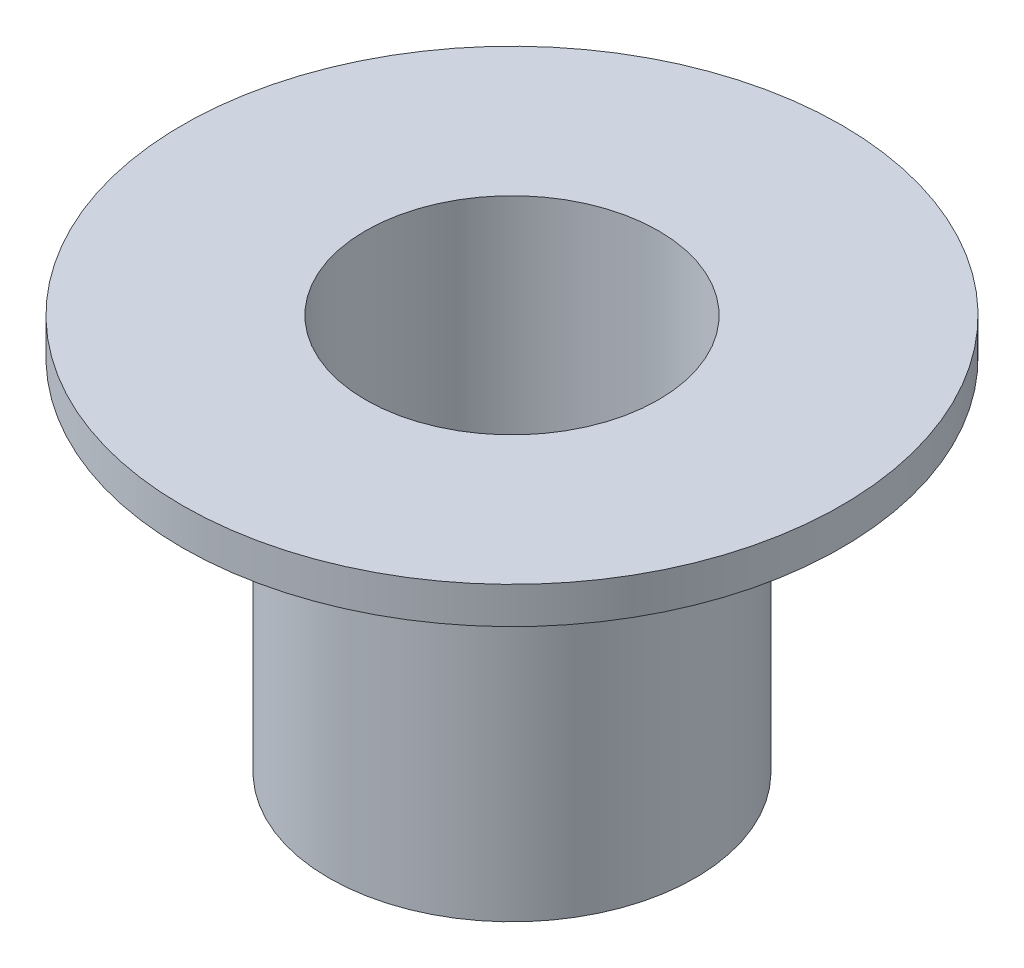
ISO-10303-21;
HEADER;
FILE_DESCRIPTION(('STEP AP214'),'2;1');
FILE_NAME('part.step','',(''),(''),'','','');
FILE_SCHEMA(('AUTOMOTIVE_DESIGN { 1 0 10303 214 1 1 1 1 }'));
ENDSEC;
DATA;
#1=APPLICATION_CONTEXT('core data for automotive mechanical design processes');
#2=APPLICATION_PROTOCOL_DEFINITION('international standard','automotive_design',2000,#1);
#3=PRODUCT_CONTEXT('',#1,'mechanical');
#4=PRODUCT('Part','Part','',(#3));
#5=PRODUCT_RELATED_PRODUCT_CATEGORY('part','',(#4));
#6=PRODUCT_DEFINITION_FORMATION('','',#4);
#7=PRODUCT_DEFINITION_CONTEXT('part definition',#1,'design');
#8=PRODUCT_DEFINITION('design','',#6,#7);
#9=PRODUCT_DEFINITION_SHAPE('','',#8);
#10=(LENGTH_UNIT() NAMED_UNIT(*) SI_UNIT(.MILLI.,.METRE.));
#11=(NAMED_UNIT(*) PLANE_ANGLE_UNIT() SI_UNIT($,.RADIAN.));
#12=(NAMED_UNIT(*) SI_UNIT($,.STERADIAN.) SOLID_ANGLE_UNIT());
#13=UNCERTAINTY_MEASURE_WITH_UNIT(LENGTH_MEASURE(1.E-05),#10,'distance_accuracy_value','');
#14=(GEOMETRIC_REPRESENTATION_CONTEXT(3) GLOBAL_UNCERTAINTY_ASSIGNED_CONTEXT((#13)) GLOBAL_UNIT_ASSIGNED_CONTEXT((#10,
#11,#12)) REPRESENTATION_CONTEXT('',''));
#15=CARTESIAN_POINT('',(0.,0.,0.));
#16=DIRECTION('',(0.,0.,1.));
#17=DIRECTION('',(1.,0.,0.));
#18=AXIS2_PLACEMENT_3D('',#15,#16,#17);
#19=CARTESIAN_POINT('',(0.,-9.81,0.));
#20=DIRECTION('',(0.,1.,0.));
#21=DIRECTION('',(0.,0.,1.));
#22=AXIS2_PLACEMENT_3D('',#19,#20,#21);
#23=CYLINDRICAL_SURFACE('',#22,5.);
#24=CARTESIAN_POINT('',(0.,-9.81,0.));
#25=DIRECTION('',(0.,1.,0.));
#26=DIRECTION('',(0.,0.,1.));
#27=AXIS2_PLACEMENT_3D('',#24,#25,#26);
#28=CIRCLE('',#27,5.);
#29=CARTESIAN_POINT('',(0.,-9.81,5.));
#30=VERTEX_POINT('',#29);
#31=EDGE_CURVE('E10',#30,#30,#28,.T.);
#32=ORIENTED_EDGE('',*,*,#31,.T.);
#33=EDGE_LOOP('',(#32));
#34=FACE_BOUND('',#33,.T.);
#35=CARTESIAN_POINT('',(0.,0.,0.));
#36=DIRECTION('',(0.,1.,0.));
#37=DIRECTION('',(0.,0.,1.));
#38=AXIS2_PLACEMENT_3D('',#35,#36,#37);
#39=CIRCLE('',#38,5.);
#40=CARTESIAN_POINT('',(0.,0.,5.));
#41=VERTEX_POINT('',#40);
#42=EDGE_CURVE('E34',#41,#41,#39,.T.);
#43=ORIENTED_EDGE('',*,*,#42,.F.);
#44=EDGE_LOOP('',(#43));
#45=FACE_BOUND('',#44,.T.);
#46=ADVANCED_FACE('F31',(#34,#45),#23,.T.);
#47=CARTESIAN_POINT('',(0.,-9.81,0.));
#48=DIRECTION('',(0.,1.,0.));
#49=DIRECTION('',(0.,0.,1.));
#50=AXIS2_PLACEMENT_3D('',#47,#48,#49);
#51=PLANE('',#50);
#52=CARTESIAN_POINT('',(0.,-9.81,0.));
#53=DIRECTION('',(0.,1.,0.));
#54=DIRECTION('',(0.,0.,1.));
#55=AXIS2_PLACEMENT_3D('',#52,#53,#54);
#56=CIRCLE('',#55,4.);
#57=CARTESIAN_POINT('',(0.,-9.81,4.));
#58=VERTEX_POINT('',#57);
#59=EDGE_CURVE('E46',#58,#58,#56,.T.);
#60=ORIENTED_EDGE('',*,*,#59,.T.);
#61=EDGE_LOOP('',(#60));
#62=FACE_BOUND('',#61,.T.);
#63=ORIENTED_EDGE('',*,*,#31,.F.);
#64=EDGE_LOOP('',(#63));
#65=FACE_BOUND('',#64,.T.);
#66=ADVANCED_FACE('F68',(#62,#65),#51,.F.);
#67=CARTESIAN_POINT('',(0.,1.,0.));
#68=DIRECTION('',(0.,-1.,0.));
#69=DIRECTION('',(0.,0.,-1.));
#70=AXIS2_PLACEMENT_3D('',#67,#68,#69);
#71=CYLINDRICAL_SURFACE('',#70,9.);
#72=CARTESIAN_POINT('',(0.,1.,0.));
#73=DIRECTION('',(0.,1.,0.));
#74=DIRECTION('',(0.,0.,1.));
#75=AXIS2_PLACEMENT_3D('',#72,#73,#74);
#76=CIRCLE('',#75,9.);
#77=CARTESIAN_POINT('',(0.,1.,9.));
#78=VERTEX_POINT('',#77);
#79=EDGE_CURVE('E41',#78,#78,#76,.T.);
#80=ORIENTED_EDGE('',*,*,#79,.F.);
#81=EDGE_LOOP('',(#80));
#82=FACE_BOUND('',#81,.T.);
#83=CARTESIAN_POINT('',(0.,0.,0.));
#84=DIRECTION('',(0.,1.,0.));
#85=DIRECTION('',(0.,0.,1.));
#86=AXIS2_PLACEMENT_3D('',#83,#84,#85);
#87=CIRCLE('',#86,9.);
#88=CARTESIAN_POINT('',(0.,0.,9.));
#89=VERTEX_POINT('',#88);
#90=EDGE_CURVE('E43',#89,#89,#87,.T.);
#91=ORIENTED_EDGE('',*,*,#90,.T.);
#92=EDGE_LOOP('',(#91));
#93=FACE_BOUND('',#92,.T.);
#94=ADVANCED_FACE('F62',(#82,#93),#71,.T.);
#95=CARTESIAN_POINT('',(0.,1.,0.));
#96=DIRECTION('',(0.,1.,0.));
#97=DIRECTION('',(0.,0.,1.));
#98=AXIS2_PLACEMENT_3D('',#95,#96,#97);
#99=PLANE('',#98);
#100=CARTESIAN_POINT('',(0.,1.,0.));
#101=DIRECTION('',(0.,1.,0.));
#102=DIRECTION('',(0.,0.,1.));
#103=AXIS2_PLACEMENT_3D('',#100,#101,#102);
#104=CIRCLE('',#103,4.);
#105=CARTESIAN_POINT('',(0.,1.,4.));
#106=VERTEX_POINT('',#105);
#107=EDGE_CURVE('E51',#106,#106,#104,.T.);
#108=ORIENTED_EDGE('',*,*,#107,.F.);
#109=EDGE_LOOP('',(#108));
#110=FACE_BOUND('',#109,.T.);
#111=ORIENTED_EDGE('',*,*,#79,.T.);
#112=EDGE_LOOP('',(#111));
#113=FACE_BOUND('',#112,.T.);
#114=ADVANCED_FACE('F58',(#110,#113),#99,.T.);
#115=CARTESIAN_POINT('',(0.,0.,0.));
#116=DIRECTION('',(0.,1.,0.));
#117=DIRECTION('',(0.,0.,1.));
#118=AXIS2_PLACEMENT_3D('',#115,#116,#117);
#119=PLANE('',#118);
#120=ORIENTED_EDGE('',*,*,#42,.T.);
#121=EDGE_LOOP('',(#120));
#122=FACE_BOUND('',#121,.T.);
#123=ORIENTED_EDGE('',*,*,#90,.F.);
#124=EDGE_LOOP('',(#123));
#125=FACE_BOUND('',#124,.T.);
#126=ADVANCED_FACE('F61',(#122,#125),#119,.F.);
#127=CARTESIAN_POINT('',(0.,-14.72,0.));
#128=DIRECTION('',(0.,1.,0.));
#129=DIRECTION('',(0.,0.,1.));
#130=AXIS2_PLACEMENT_3D('',#127,#128,#129);
#131=CYLINDRICAL_SURFACE('',#130,4.);
#132=ORIENTED_EDGE('',*,*,#107,.T.);
#133=EDGE_LOOP('',(#132));
#134=FACE_BOUND('',#133,.T.);
#135=ORIENTED_EDGE('',*,*,#59,.F.);
#136=EDGE_LOOP('',(#135));
#137=FACE_BOUND('',#136,.T.);
#138=ADVANCED_FACE('F55',(#134,#137),#131,.F.);
#139=CLOSED_SHELL('',(#46,#66,#94,#114,#126,#138));
#140=MANIFOLD_SOLID_BREP('B2',#139);
#141=ADVANCED_BREP_SHAPE_REPRESENTATION('',(#18,#140),#14);
#142=SHAPE_DEFINITION_REPRESENTATION(#9,#141);
ENDSEC;
END-ISO-10303-21;
